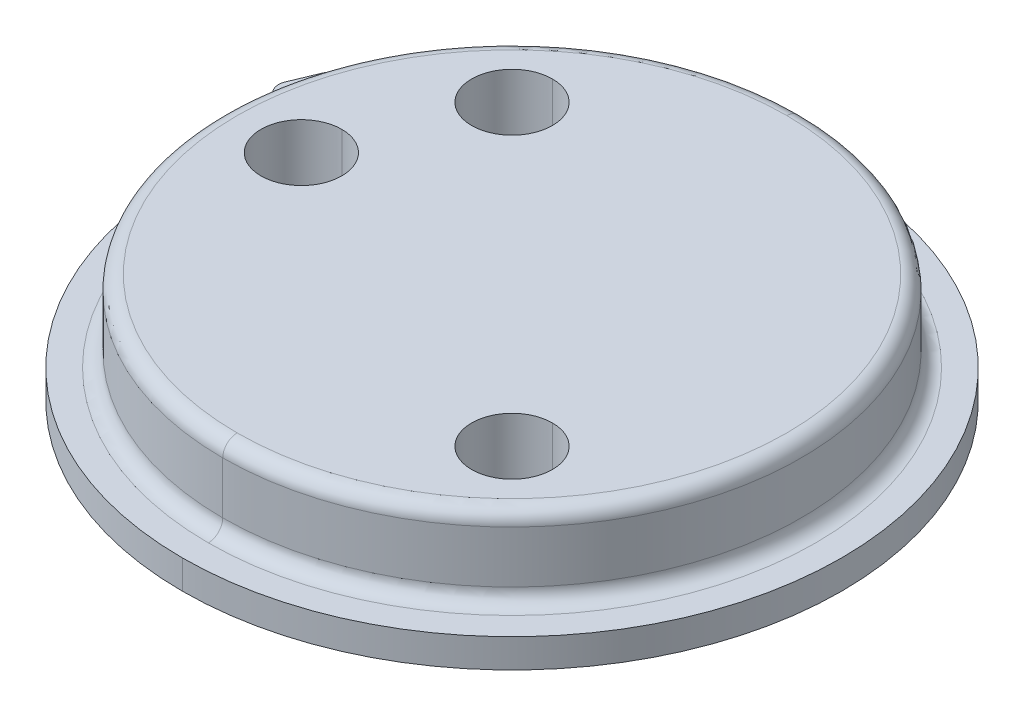
ISO-10303-21;
HEADER;
FILE_DESCRIPTION(('STEP AP214'),'2;1');
FILE_NAME('part.step','',(''),(''),'','','');
FILE_SCHEMA(('AUTOMOTIVE_DESIGN { 1 0 10303 214 1 1 1 1 }'));
ENDSEC;
DATA;
#1=APPLICATION_CONTEXT('core data for automotive mechanical design processes');
#2=APPLICATION_PROTOCOL_DEFINITION('international standard','automotive_design',2000,#1);
#3=PRODUCT_CONTEXT('',#1,'mechanical');
#4=PRODUCT('Part','Part','',(#3));
#5=PRODUCT_RELATED_PRODUCT_CATEGORY('part','',(#4));
#6=PRODUCT_DEFINITION_FORMATION('','',#4);
#7=PRODUCT_DEFINITION_CONTEXT('part definition',#1,'design');
#8=PRODUCT_DEFINITION('design','',#6,#7);
#9=PRODUCT_DEFINITION_SHAPE('','',#8);
#10=(LENGTH_UNIT() NAMED_UNIT(*) SI_UNIT(.MILLI.,.METRE.));
#11=(NAMED_UNIT(*) PLANE_ANGLE_UNIT() SI_UNIT($,.RADIAN.));
#12=(NAMED_UNIT(*) SI_UNIT($,.STERADIAN.) SOLID_ANGLE_UNIT());
#13=UNCERTAINTY_MEASURE_WITH_UNIT(LENGTH_MEASURE(1.E-05),#10,'distance_accuracy_value','');
#14=(GEOMETRIC_REPRESENTATION_CONTEXT(3) GLOBAL_UNCERTAINTY_ASSIGNED_CONTEXT((#13)) GLOBAL_UNIT_ASSIGNED_CONTEXT((#10,
#11,#12)) REPRESENTATION_CONTEXT('',''));
#15=CARTESIAN_POINT('',(0.,0.,0.));
#16=DIRECTION('',(0.,0.,1.));
#17=DIRECTION('',(1.,0.,0.));
#18=AXIS2_PLACEMENT_3D('',#15,#16,#17);
#19=CARTESIAN_POINT('',(-2.92,0.,0.));
#20=DIRECTION('',(0.,1.,0.));
#21=DIRECTION('',(0.,0.,1.));
#22=AXIS2_PLACEMENT_3D('',#19,#20,#21);
#23=CYLINDRICAL_SURFACE('',#22,0.56);
#24=DIRECTION('',(0.,-1.,0.));
#25=VECTOR('',#24,1.);
#26=CARTESIAN_POINT('',(-2.92,1.52,-0.56));
#27=LINE('',#26,#25);
#28=CARTESIAN_POINT('',(-2.92,1.52,-0.56));
#29=VERTEX_POINT('',#28);
#30=CARTESIAN_POINT('',(-2.92,0.,-0.56));
#31=VERTEX_POINT('',#30);
#32=EDGE_CURVE('E11',#29,#31,#27,.T.);
#33=ORIENTED_EDGE('',*,*,#32,.F.);
#34=CARTESIAN_POINT('',(-2.92,1.52,0.));
#35=DIRECTION('',(0.,-1.,0.));
#36=DIRECTION('',(0.,0.,1.));
#37=AXIS2_PLACEMENT_3D('',#34,#35,#36);
#38=CIRCLE('',#37,0.56);
#39=CARTESIAN_POINT('',(-2.92,1.52,0.56));
#40=VERTEX_POINT('',#39);
#41=EDGE_CURVE('E358',#40,#29,#38,.T.);
#42=ORIENTED_EDGE('',*,*,#41,.F.);
#43=DIRECTION('',(0.,-1.,0.));
#44=VECTOR('',#43,1.);
#45=CARTESIAN_POINT('',(-2.92,1.52,0.56));
#46=LINE('',#45,#44);
#47=CARTESIAN_POINT('',(-2.92,0.,0.56));
#48=VERTEX_POINT('',#47);
#49=EDGE_CURVE('E27',#40,#48,#46,.T.);
#50=ORIENTED_EDGE('',*,*,#49,.T.);
#51=CARTESIAN_POINT('',(-2.92,0.,0.));
#52=DIRECTION('',(0.,1.,0.));
#53=DIRECTION('',(0.,0.,-1.));
#54=AXIS2_PLACEMENT_3D('',#51,#52,#53);
#55=CIRCLE('',#54,0.56);
#56=EDGE_CURVE('E353',#31,#48,#55,.T.);
#57=ORIENTED_EDGE('',*,*,#56,.F.);
#58=EDGE_LOOP('',(#33,#42,#50,#57));
#59=FACE_BOUND('',#58,.T.);
#60=ADVANCED_FACE('F16',(#59),#23,.F.);
#61=CARTESIAN_POINT('',(-2.92,0.,0.));
#62=DIRECTION('',(0.,1.,0.));
#63=DIRECTION('',(0.,0.,1.));
#64=AXIS2_PLACEMENT_3D('',#61,#62,#63);
#65=CYLINDRICAL_SURFACE('',#64,0.56);
#66=CARTESIAN_POINT('',(-2.92,0.,0.));
#67=DIRECTION('',(0.,1.,0.));
#68=DIRECTION('',(0.,0.,1.));
#69=AXIS2_PLACEMENT_3D('',#66,#67,#68);
#70=CIRCLE('',#69,0.56);
#71=EDGE_CURVE('E371',#48,#31,#70,.T.);
#72=ORIENTED_EDGE('',*,*,#71,.F.);
#73=ORIENTED_EDGE('',*,*,#49,.F.);
#74=CARTESIAN_POINT('',(-2.92,1.52,0.));
#75=DIRECTION('',(0.,-1.,0.));
#76=DIRECTION('',(0.,0.,-1.));
#77=AXIS2_PLACEMENT_3D('',#74,#75,#76);
#78=CIRCLE('',#77,0.56);
#79=EDGE_CURVE('E354',#29,#40,#78,.T.);
#80=ORIENTED_EDGE('',*,*,#79,.F.);
#81=ORIENTED_EDGE('',*,*,#32,.T.);
#82=EDGE_LOOP('',(#72,#73,#80,#81));
#83=FACE_BOUND('',#82,.T.);
#84=ADVANCED_FACE('F593',(#83),#65,.F.);
#85=CARTESIAN_POINT('',(2.92,0.15,0.));
#86=DIRECTION('',(0.,-1.,0.));
#87=DIRECTION('',(0.,0.,-1.));
#88=AXIS2_PLACEMENT_3D('',#85,#86,#87);
#89=PLANE('',#88);
#90=CARTESIAN_POINT('',(2.92,0.15,0.));
#91=DIRECTION('',(0.,-1.,0.));
#92=DIRECTION('',(0.,0.,1.));
#93=AXIS2_PLACEMENT_3D('',#90,#91,#92);
#94=CIRCLE('',#93,0.35);
#95=CARTESIAN_POINT('',(2.92,0.15,0.35));
#96=VERTEX_POINT('',#95);
#97=CARTESIAN_POINT('',(2.92,0.15,-0.35));
#98=VERTEX_POINT('',#97);
#99=EDGE_CURVE('E41',#96,#98,#94,.T.);
#100=ORIENTED_EDGE('',*,*,#99,.T.);
#101=CARTESIAN_POINT('',(2.92,0.15,0.));
#102=DIRECTION('',(0.,-1.,0.));
#103=DIRECTION('',(0.,0.,-1.));
#104=AXIS2_PLACEMENT_3D('',#101,#102,#103);
#105=CIRCLE('',#104,0.35);
#106=EDGE_CURVE('E278',#98,#96,#105,.T.);
#107=ORIENTED_EDGE('',*,*,#106,.T.);
#108=EDGE_LOOP('',(#100,#107));
#109=FACE_BOUND('',#108,.T.);
#110=ADVANCED_FACE('F486',(#109),#89,.T.);
#111=CARTESIAN_POINT('',(2.92,0.15,0.));
#112=DIRECTION('',(0.,-1.,0.));
#113=DIRECTION('',(0.,0.,-1.));
#114=AXIS2_PLACEMENT_3D('',#111,#112,#113);
#115=CYLINDRICAL_SURFACE('',#114,0.35);
#116=DIRECTION('',(0.,1.,0.));
#117=VECTOR('',#116,1.);
#118=CARTESIAN_POINT('',(2.92,0.,0.35));
#119=LINE('',#118,#117);
#120=CARTESIAN_POINT('',(2.92,0.,0.35));
#121=VERTEX_POINT('',#120);
#122=EDGE_CURVE('E277',#121,#96,#119,.T.);
#123=ORIENTED_EDGE('',*,*,#122,.F.);
#124=CARTESIAN_POINT('',(2.92,0.,0.));
#125=DIRECTION('',(0.,1.,0.));
#126=DIRECTION('',(0.,0.,-1.));
#127=AXIS2_PLACEMENT_3D('',#124,#125,#126);
#128=CIRCLE('',#127,0.35);
#129=CARTESIAN_POINT('',(2.92,0.,-0.35));
#130=VERTEX_POINT('',#129);
#131=EDGE_CURVE('E326',#130,#121,#128,.T.);
#132=ORIENTED_EDGE('',*,*,#131,.F.);
#133=DIRECTION('',(0.,1.,0.));
#134=VECTOR('',#133,1.);
#135=CARTESIAN_POINT('',(2.92,0.,-0.35));
#136=LINE('',#135,#134);
#137=EDGE_CURVE('E274',#130,#98,#136,.T.);
#138=ORIENTED_EDGE('',*,*,#137,.T.);
#139=ORIENTED_EDGE('',*,*,#99,.F.);
#140=EDGE_LOOP('',(#123,#132,#138,#139));
#141=FACE_BOUND('',#140,.T.);
#142=ADVANCED_FACE('F487',(#141),#115,.F.);
#143=CARTESIAN_POINT('',(2.92,0.15,0.));
#144=DIRECTION('',(0.,-1.,0.));
#145=DIRECTION('',(0.,0.,-1.));
#146=AXIS2_PLACEMENT_3D('',#143,#144,#145);
#147=CYLINDRICAL_SURFACE('',#146,0.35);
#148=ORIENTED_EDGE('',*,*,#106,.F.);
#149=ORIENTED_EDGE('',*,*,#137,.F.);
#150=CARTESIAN_POINT('',(2.92,0.,0.));
#151=DIRECTION('',(0.,1.,0.));
#152=DIRECTION('',(0.,0.,1.));
#153=AXIS2_PLACEMENT_3D('',#150,#151,#152);
#154=CIRCLE('',#153,0.35);
#155=EDGE_CURVE('E330',#121,#130,#154,.T.);
#156=ORIENTED_EDGE('',*,*,#155,.F.);
#157=ORIENTED_EDGE('',*,*,#122,.T.);
#158=EDGE_LOOP('',(#148,#149,#156,#157));
#159=FACE_BOUND('',#158,.T.);
#160=ADVANCED_FACE('F483',(#159),#147,.F.);
#161=CARTESIAN_POINT('',(-2.064751801065,1.52,-2.064751801065));
#162=DIRECTION('',(0.,-1.,0.));
#163=DIRECTION('',(0.,0.,-1.));
#164=AXIS2_PLACEMENT_3D('',#161,#162,#163);
#165=CYLINDRICAL_SURFACE('',#164,0.56);
#166=DIRECTION('',(0.,1.,0.));
#167=VECTOR('',#166,1.);
#168=CARTESIAN_POINT('',(-2.064751801065,0.,-1.504751801065));
#169=LINE('',#168,#167);
#170=CARTESIAN_POINT('',(-2.064751801065,0.,-1.504751801065));
#171=VERTEX_POINT('',#170);
#172=CARTESIAN_POINT('',(-2.064751801065,1.52,-1.504751801065));
#173=VERTEX_POINT('',#172);
#174=EDGE_CURVE('E349',#171,#173,#169,.T.);
#175=ORIENTED_EDGE('',*,*,#174,.F.);
#176=CARTESIAN_POINT('',(-2.064751801065,0.,-2.064751801065));
#177=DIRECTION('',(0.,1.,0.));
#178=DIRECTION('',(0.,0.,-1.));
#179=AXIS2_PLACEMENT_3D('',#176,#177,#178);
#180=CIRCLE('',#179,0.56);
#181=CARTESIAN_POINT('',(-2.064751801065,0.,-2.624751801065));
#182=VERTEX_POINT('',#181);
#183=EDGE_CURVE('E301',#182,#171,#180,.T.);
#184=ORIENTED_EDGE('',*,*,#183,.F.);
#185=DIRECTION('',(0.,1.,0.));
#186=VECTOR('',#185,1.);
#187=CARTESIAN_POINT('',(-2.064751801065,0.,-2.624751801065));
#188=LINE('',#187,#186);
#189=CARTESIAN_POINT('',(-2.064751801065,1.52,-2.624751801065));
#190=VERTEX_POINT('',#189);
#191=EDGE_CURVE('E366',#182,#190,#188,.T.);
#192=ORIENTED_EDGE('',*,*,#191,.T.);
#193=CARTESIAN_POINT('',(-2.064751801065,1.52,-2.064751801065));
#194=DIRECTION('',(0.,-1.,0.));
#195=DIRECTION('',(0.,0.,1.));
#196=AXIS2_PLACEMENT_3D('',#193,#194,#195);
#197=CIRCLE('',#196,0.56);
#198=EDGE_CURVE('E419',#173,#190,#197,.T.);
#199=ORIENTED_EDGE('',*,*,#198,.F.);
#200=EDGE_LOOP('',(#175,#184,#192,#199));
#201=FACE_BOUND('',#200,.T.);
#202=ADVANCED_FACE('F636',(#201),#165,.F.);
#203=CARTESIAN_POINT('',(-2.064751801065,1.52,-2.064751801065));
#204=DIRECTION('',(0.,-1.,0.));
#205=DIRECTION('',(0.,0.,-1.));
#206=AXIS2_PLACEMENT_3D('',#203,#204,#205);
#207=CYLINDRICAL_SURFACE('',#206,0.56);
#208=CARTESIAN_POINT('',(-2.064751801065,1.52,-2.064751801065));
#209=DIRECTION('',(0.,-1.,0.));
#210=DIRECTION('',(0.,0.,-1.));
#211=AXIS2_PLACEMENT_3D('',#208,#209,#210);
#212=CIRCLE('',#211,0.56);
#213=EDGE_CURVE('E423',#190,#173,#212,.T.);
#214=ORIENTED_EDGE('',*,*,#213,.F.);
#215=ORIENTED_EDGE('',*,*,#191,.F.);
#216=CARTESIAN_POINT('',(-2.064751801065,0.,-2.064751801065));
#217=DIRECTION('',(0.,1.,0.));
#218=DIRECTION('',(0.,0.,1.));
#219=AXIS2_PLACEMENT_3D('',#216,#217,#218);
#220=CIRCLE('',#219,0.56);
#221=EDGE_CURVE('E305',#171,#182,#220,.T.);
#222=ORIENTED_EDGE('',*,*,#221,.F.);
#223=ORIENTED_EDGE('',*,*,#174,.T.);
#224=EDGE_LOOP('',(#214,#215,#222,#223));
#225=FACE_BOUND('',#224,.T.);
#226=ADVANCED_FACE('F621',(#225),#207,.F.);
#227=CARTESIAN_POINT('',(0.,28.41036291267,0.));
#228=DIRECTION('',(0.,1.,0.));
#229=DIRECTION('',(0.,0.,1.));
#230=AXIS2_PLACEMENT_3D('',#227,#228,#229);
#231=CYLINDRICAL_SURFACE('',#230,4.57);
#232=DIRECTION('',(0.,-1.,0.));
#233=VECTOR('',#232,1.);
#234=CARTESIAN_POINT('',(0.,0.4,-4.57));
#235=LINE('',#234,#233);
#236=CARTESIAN_POINT('',(0.,0.4,-4.57));
#237=VERTEX_POINT('',#236);
#238=CARTESIAN_POINT('',(0.,0.,-4.57));
#239=VERTEX_POINT('',#238);
#240=EDGE_CURVE('E267',#237,#239,#235,.T.);
#241=ORIENTED_EDGE('',*,*,#240,.F.);
#242=CARTESIAN_POINT('',(0.,0.4,0.));
#243=DIRECTION('',(0.,1.,0.));
#244=DIRECTION('',(0.,0.,1.));
#245=AXIS2_PLACEMENT_3D('',#242,#243,#244);
#246=CIRCLE('',#245,4.57);
#247=CARTESIAN_POINT('',(0.,0.4,4.57));
#248=VERTEX_POINT('',#247);
#249=EDGE_CURVE('E335',#248,#237,#246,.T.);
#250=ORIENTED_EDGE('',*,*,#249,.F.);
#251=DIRECTION('',(0.,-1.,0.));
#252=VECTOR('',#251,1.);
#253=CARTESIAN_POINT('',(0.,0.4,4.57));
#254=LINE('',#253,#252);
#255=CARTESIAN_POINT('',(0.,0.,4.57));
#256=VERTEX_POINT('',#255);
#257=EDGE_CURVE('E367',#248,#256,#254,.T.);
#258=ORIENTED_EDGE('',*,*,#257,.T.);
#259=CARTESIAN_POINT('',(0.,0.,0.));
#260=DIRECTION('',(0.,-1.,0.));
#261=DIRECTION('',(0.,0.,-1.));
#262=AXIS2_PLACEMENT_3D('',#259,#260,#261);
#263=CIRCLE('',#262,4.57);
#264=EDGE_CURVE('E384',#239,#256,#263,.T.);
#265=ORIENTED_EDGE('',*,*,#264,.F.);
#266=EDGE_LOOP('',(#241,#250,#258,#265));
#267=FACE_BOUND('',#266,.T.);
#268=ADVANCED_FACE('F572',(#267),#231,.T.);
#269=CARTESIAN_POINT('',(0.,28.41036291267,0.));
#270=DIRECTION('',(0.,1.,0.));
#271=DIRECTION('',(0.,0.,1.));
#272=AXIS2_PLACEMENT_3D('',#269,#270,#271);
#273=CYLINDRICAL_SURFACE('',#272,4.57);
#274=CARTESIAN_POINT('',(0.,0.,0.));
#275=DIRECTION('',(0.,-1.,0.));
#276=DIRECTION('',(-0.87416579232243,0.,-0.485627601700417));
#277=AXIS2_PLACEMENT_3D('',#274,#275,#276);
#278=CIRCLE('',#277,4.57);
#279=CARTESIAN_POINT('',(-3.994937670913,0.,-2.219318139771));
#280=VERTEX_POINT('',#279);
#281=EDGE_CURVE('E377',#280,#239,#278,.T.);
#282=ORIENTED_EDGE('',*,*,#281,.F.);
#283=DIRECTION('',(0.,1.,0.));
#284=VECTOR('',#283,1.);
#285=CARTESIAN_POINT('',(-3.994937670913,0.,-2.219318139771));
#286=LINE('',#285,#284);
#287=CARTESIAN_POINT('',(-3.994937670913,0.4,-2.219318139771));
#288=VERTEX_POINT('',#287);
#289=EDGE_CURVE('E225',#280,#288,#286,.T.);
#290=ORIENTED_EDGE('',*,*,#289,.T.);
#291=CARTESIAN_POINT('',(0.,0.4,0.));
#292=DIRECTION('',(0.,1.,0.));
#293=DIRECTION('',(0.,0.,-1.));
#294=AXIS2_PLACEMENT_3D('',#291,#292,#293);
#295=CIRCLE('',#294,4.57);
#296=EDGE_CURVE('E248',#237,#288,#295,.T.);
#297=ORIENTED_EDGE('',*,*,#296,.F.);
#298=ORIENTED_EDGE('',*,*,#240,.T.);
#299=EDGE_LOOP('',(#282,#290,#297,#298));
#300=FACE_BOUND('',#299,.T.);
#301=ADVANCED_FACE('F569',(#300),#273,.T.);
#302=CARTESIAN_POINT('',(-4.134786782159,0.4,-2.362294452788));
#303=DIRECTION('',(0.,-1.,0.));
#304=DIRECTION('',(0.,0.,-1.));
#305=AXIS2_PLACEMENT_3D('',#302,#303,#304);
#306=CYLINDRICAL_SURFACE('',#305,0.2);
#307=CARTESIAN_POINT('',(-4.134786782159,0.,-2.362294452788));
#308=DIRECTION('',(0.,1.,0.));
#309=DIRECTION('',(-0.382437806275593,0.,0.923981235919384));
#310=AXIS2_PLACEMENT_3D('',#307,#308,#309);
#311=CIRCLE('',#310,0.2);
#312=CARTESIAN_POINT('',(-4.211274343414,0.,-2.177498205604));
#313=VERTEX_POINT('',#312);
#314=CARTESIAN_POINT('',(-4.134786782159,0.,-2.162294452788));
#315=VERTEX_POINT('',#314);
#316=EDGE_CURVE('E220',#313,#315,#311,.T.);
#317=ORIENTED_EDGE('',*,*,#316,.F.);
#318=DIRECTION('',(0.,1.,0.));
#319=VECTOR('',#318,1.);
#320=CARTESIAN_POINT('',(-4.211274343414,0.,-2.177498205604));
#321=LINE('',#320,#319);
#322=CARTESIAN_POINT('',(-4.211274343414,0.4,-2.177498205604));
#323=VERTEX_POINT('',#322);
#324=EDGE_CURVE('E212',#313,#323,#321,.T.);
#325=ORIENTED_EDGE('',*,*,#324,.T.);
#326=CARTESIAN_POINT('',(-4.134786782159,0.4,-2.362294452788));
#327=DIRECTION('',(0.,-1.,0.));
#328=DIRECTION('',(0.,0.,1.));
#329=AXIS2_PLACEMENT_3D('',#326,#327,#328);
#330=CIRCLE('',#329,0.2);
#331=CARTESIAN_POINT('',(-4.134786782159,0.4,-2.162294452788));
#332=VERTEX_POINT('',#331);
#333=EDGE_CURVE('E217',#332,#323,#330,.T.);
#334=ORIENTED_EDGE('',*,*,#333,.F.);
#335=CARTESIAN_POINT('',(-4.134786782159,0.4,-2.362294452788));
#336=DIRECTION('',(0.,-1.,0.));
#337=DIRECTION('',(0.699245556225529,0.,0.71488156508533));
#338=AXIS2_PLACEMENT_3D('',#335,#336,#337);
#339=CIRCLE('',#338,0.2);
#340=EDGE_CURVE('E240',#288,#332,#339,.T.);
#341=ORIENTED_EDGE('',*,*,#340,.F.);
#342=ORIENTED_EDGE('',*,*,#289,.F.);
#343=CARTESIAN_POINT('',(-4.134786782159,0.,-2.362294452788));
#344=DIRECTION('',(0.,1.,0.));
#345=DIRECTION('',(0.,0.,1.));
#346=AXIS2_PLACEMENT_3D('',#343,#344,#345);
#347=CIRCLE('',#346,0.2);
#348=EDGE_CURVE('E373',#315,#280,#347,.T.);
#349=ORIENTED_EDGE('',*,*,#348,.F.);
#350=EDGE_LOOP('',(#317,#325,#334,#341,#342,#349));
#351=FACE_BOUND('',#350,.T.);
#352=ADVANCED_FACE('F214',(#351),#306,.F.);
#353=CARTESIAN_POINT('',(0.153517022237,0.4,-0.3709017403969));
#354=DIRECTION('',(0.382437806275593,0.,-0.923981235919384));
#355=DIRECTION('',(0.,-1.,0.));
#356=AXIS2_PLACEMENT_3D('',#353,#354,#355);
#357=PLANE('',#356);
#358=DIRECTION('',(0.,-1.,0.));
#359=VECTOR('',#358,1.);
#360=CARTESIAN_POINT('',(-4.586457409547,0.4,-2.332787277704));
#361=LINE('',#360,#359);
#362=CARTESIAN_POINT('',(-4.586457409547,0.4,-2.332787277704));
#363=VERTEX_POINT('',#362);
#364=CARTESIAN_POINT('',(-4.586457409547,0.,-2.332787277704));
#365=VERTEX_POINT('',#364);
#366=EDGE_CURVE('E226',#363,#365,#361,.T.);
#367=ORIENTED_EDGE('',*,*,#366,.F.);
#368=DIRECTION('',(-0.923981235919384,0.,-0.382437806275593));
#369=VECTOR('',#368,1.);
#370=CARTESIAN_POINT('',(-4.211274343414,0.4,-2.177498205604));
#371=LINE('',#370,#369);
#372=EDGE_CURVE('E229',#323,#363,#371,.T.);
#373=ORIENTED_EDGE('',*,*,#372,.F.);
#374=ORIENTED_EDGE('',*,*,#324,.F.);
#375=DIRECTION('',(0.923981235919384,0.,0.382437806275593));
#376=VECTOR('',#375,1.);
#377=CARTESIAN_POINT('',(-4.586457409547,0.,-2.332787277704));
#378=LINE('',#377,#376);
#379=EDGE_CURVE('E339',#365,#313,#378,.T.);
#380=ORIENTED_EDGE('',*,*,#379,.F.);
#381=EDGE_LOOP('',(#367,#373,#374,#380));
#382=FACE_BOUND('',#381,.T.);
#383=ADVANCED_FACE('F230',(#382),#357,.T.);
#384=CARTESIAN_POINT('',(-4.662944970803,0.4,-2.147991030521));
#385=DIRECTION('',(0.,-1.,0.));
#386=DIRECTION('',(0.,0.,-1.));
#387=AXIS2_PLACEMENT_3D('',#384,#385,#386);
#388=CYLINDRICAL_SURFACE('',#387,0.2);
#389=CARTESIAN_POINT('',(-4.662944970803,0.4,-2.147991030521));
#390=DIRECTION('',(0.,1.,0.));
#391=DIRECTION('',(0.382437806275593,0.,-0.923981235919384));
#392=AXIS2_PLACEMENT_3D('',#389,#390,#391);
#393=CIRCLE('',#392,0.2);
#394=CARTESIAN_POINT('',(-4.662944970803,0.4,-2.347991030521));
#395=VERTEX_POINT('',#394);
#396=EDGE_CURVE('E235',#363,#395,#393,.T.);
#397=ORIENTED_EDGE('',*,*,#396,.F.);
#398=ORIENTED_EDGE('',*,*,#366,.T.);
#399=CARTESIAN_POINT('',(-4.662944970803,0.,-2.147991030521));
#400=DIRECTION('',(0.,-1.,0.));
#401=DIRECTION('',(0.,0.,-1.));
#402=AXIS2_PLACEMENT_3D('',#399,#400,#401);
#403=CIRCLE('',#402,0.2);
#404=CARTESIAN_POINT('',(-4.662944970803,0.,-2.347991030521));
#405=VERTEX_POINT('',#404);
#406=EDGE_CURVE('E342',#405,#365,#403,.T.);
#407=ORIENTED_EDGE('',*,*,#406,.F.);
#408=DIRECTION('',(0.,1.,0.));
#409=VECTOR('',#408,1.);
#410=CARTESIAN_POINT('',(-4.662944970803,0.,-2.347991030521));
#411=LINE('',#410,#409);
#412=EDGE_CURVE('E295',#405,#395,#411,.T.);
#413=ORIENTED_EDGE('',*,*,#412,.T.);
#414=EDGE_LOOP('',(#397,#398,#407,#413));
#415=FACE_BOUND('',#414,.T.);
#416=ADVANCED_FACE('F528',(#415),#388,.T.);
#417=CARTESIAN_POINT('',(-4.21,0.4,0.));
#418=DIRECTION('',(0.,1.,0.));
#419=DIRECTION('',(1.,0.,0.));
#420=AXIS2_PLACEMENT_3D('',#417,#418,#419);
#421=PLANE('',#420);
#422=CARTESIAN_POINT('',(0.,0.4,0.));
#423=DIRECTION('',(0.,-1.,0.));
#424=DIRECTION('',(0.,0.,1.));
#425=AXIS2_PLACEMENT_3D('',#422,#423,#424);
#426=CIRCLE('',#425,4.21);
#427=CARTESIAN_POINT('',(0.,0.4,4.21));
#428=VERTEX_POINT('',#427);
#429=CARTESIAN_POINT('',(0.,0.4,-4.21));
#430=VERTEX_POINT('',#429);
#431=EDGE_CURVE('E316',#428,#430,#426,.T.);
#432=ORIENTED_EDGE('',*,*,#431,.T.);
#433=CARTESIAN_POINT('',(0.,0.4,0.));
#434=DIRECTION('',(0.,-1.,0.));
#435=DIRECTION('',(0.,0.,-1.));
#436=AXIS2_PLACEMENT_3D('',#433,#434,#435);
#437=CIRCLE('',#436,4.21);
#438=EDGE_CURVE('E363',#430,#428,#437,.T.);
#439=ORIENTED_EDGE('',*,*,#438,.T.);
#440=EDGE_LOOP('',(#432,#439));
#441=FACE_BOUND('',#440,.T.);
#442=ORIENTED_EDGE('',*,*,#249,.T.);
#443=ORIENTED_EDGE('',*,*,#296,.T.);
#444=ORIENTED_EDGE('',*,*,#340,.T.);
#445=ORIENTED_EDGE('',*,*,#333,.T.);
#446=ORIENTED_EDGE('',*,*,#372,.T.);
#447=ORIENTED_EDGE('',*,*,#396,.T.);
#448=CARTESIAN_POINT('',(-4.662944970803,0.4,-2.147991030521));
#449=DIRECTION('',(0.,1.,0.));
#450=DIRECTION('',(0.,0.,-1.));
#451=AXIS2_PLACEMENT_3D('',#448,#449,#450);
#452=CIRCLE('',#451,0.2);
#453=CARTESIAN_POINT('',(-4.847720877305,0.4,-2.224527716994));
#454=VERTEX_POINT('',#453);
#455=EDGE_CURVE('E338',#395,#454,#452,.T.);
#456=ORIENTED_EDGE('',*,*,#455,.T.);
#457=DIRECTION('',(-0.382683432365094,0.,0.923879532511285));
#458=VECTOR('',#457,1.);
#459=CARTESIAN_POINT('',(-4.847720877305,0.4,-2.224527716994));
#460=LINE('',#459,#458);
#461=CARTESIAN_POINT('',(-5.000280636424,0.4,-1.856215877457));
#462=VERTEX_POINT('',#461);
#463=EDGE_CURVE('E296',#454,#462,#460,.T.);
#464=ORIENTED_EDGE('',*,*,#463,.T.);
#465=CARTESIAN_POINT('',(-4.815504729921,0.4,-1.779679190984));
#466=DIRECTION('',(0.,1.,0.));
#467=DIRECTION('',(-0.923879532511285,0.,-0.382683432365094));
#468=AXIS2_PLACEMENT_3D('',#465,#466,#467);
#469=CIRCLE('',#468,0.2);
#470=CARTESIAN_POINT('',(-4.890754973869,0.4,-1.594375654088));
#471=VERTEX_POINT('',#470);
#472=EDGE_CURVE('E20',#462,#471,#469,.T.);
#473=ORIENTED_EDGE('',*,*,#472,.T.);
#474=DIRECTION('',(0.926517684476062,0.,0.376251219736385));
#475=VECTOR('',#474,1.);
#476=CARTESIAN_POINT('',(-4.890754973869,0.4,-1.594375654088));
#477=LINE('',#476,#475);
#478=CARTESIAN_POINT('',(-4.517067570848,0.4,-1.4426242698));
#479=VERTEX_POINT('',#478);
#480=EDGE_CURVE('E285',#471,#479,#477,.T.);
#481=ORIENTED_EDGE('',*,*,#480,.T.);
#482=CARTESIAN_POINT('',(-4.592317814796,0.4,-1.257320732905));
#483=DIRECTION('',(0.,-1.,0.));
#484=DIRECTION('',(0.376251219736385,0.,-0.926517684476062));
#485=AXIS2_PLACEMENT_3D('',#482,#483,#484);
#486=CIRCLE('',#485,0.2);
#487=CARTESIAN_POINT('',(-4.392366868823,0.4,-1.261750090021));
#488=VERTEX_POINT('',#487);
#489=EDGE_CURVE('E331',#479,#488,#486,.T.);
#490=ORIENTED_EDGE('',*,*,#489,.T.);
#491=CARTESIAN_POINT('',(0.,0.4,0.));
#492=DIRECTION('',(0.,1.,0.));
#493=DIRECTION('',(-0.96113060586928,0.,-0.276094111602094));
#494=AXIS2_PLACEMENT_3D('',#491,#492,#493);
#495=CIRCLE('',#494,4.57);
#496=EDGE_CURVE('E370',#488,#248,#495,.T.);
#497=ORIENTED_EDGE('',*,*,#496,.T.);
#498=EDGE_LOOP('',(#442,#443,#444,#445,#446,#447,#456,#464,#473,#481,#490,#497));
#499=FACE_BOUND('',#498,.T.);
#500=ADVANCED_FACE('F238',(#441,#499),#421,.T.);
#501=CARTESIAN_POINT('',(-4.662944970803,0.4,-2.147991030521));
#502=DIRECTION('',(0.,-1.,0.));
#503=DIRECTION('',(0.,0.,-1.));
#504=AXIS2_PLACEMENT_3D('',#501,#502,#503);
#505=CYLINDRICAL_SURFACE('',#504,0.2);
#506=ORIENTED_EDGE('',*,*,#412,.F.);
#507=CARTESIAN_POINT('',(-4.662944970803,0.,-2.147991030521));
#508=DIRECTION('',(0.,-1.,0.));
#509=DIRECTION('',(-0.923879532511285,0.,-0.382683432365094));
#510=AXIS2_PLACEMENT_3D('',#507,#508,#509);
#511=CIRCLE('',#510,0.2);
#512=CARTESIAN_POINT('',(-4.847720877305,0.,-2.224527716994));
#513=VERTEX_POINT('',#512);
#514=EDGE_CURVE('E400',#513,#405,#511,.T.);
#515=ORIENTED_EDGE('',*,*,#514,.F.);
#516=DIRECTION('',(0.,1.,0.));
#517=VECTOR('',#516,1.);
#518=CARTESIAN_POINT('',(-4.847720877305,0.,-2.224527716994));
#519=LINE('',#518,#517);
#520=EDGE_CURVE('E291',#513,#454,#519,.T.);
#521=ORIENTED_EDGE('',*,*,#520,.T.);
#522=ORIENTED_EDGE('',*,*,#455,.F.);
#523=EDGE_LOOP('',(#506,#515,#521,#522));
#524=FACE_BOUND('',#523,.T.);
#525=ADVANCED_FACE('F523',(#524),#505,.T.);
#526=CARTESIAN_POINT('',(-4.924277908285,0.4,-2.039702694506));
#527=DIRECTION('',(-0.923879532511285,0.,-0.382683432365094));
#528=DIRECTION('',(-0.382683432365094,0.,0.923879532511285));
#529=AXIS2_PLACEMENT_3D('',#526,#527,#528);
#530=PLANE('',#529);
#531=DIRECTION('',(0.,-1.,0.));
#532=VECTOR('',#531,1.);
#533=CARTESIAN_POINT('',(-5.000280636424,0.4,-1.856215877457));
#534=LINE('',#533,#532);
#535=CARTESIAN_POINT('',(-5.000280636424,0.,-1.856215877457));
#536=VERTEX_POINT('',#535);
#537=EDGE_CURVE('E385',#462,#536,#534,.T.);
#538=ORIENTED_EDGE('',*,*,#537,.F.);
#539=ORIENTED_EDGE('',*,*,#463,.F.);
#540=ORIENTED_EDGE('',*,*,#520,.F.);
#541=DIRECTION('',(0.382683432365094,0.,-0.923879532511285));
#542=VECTOR('',#541,1.);
#543=CARTESIAN_POINT('',(-5.000280636424,0.,-1.856215877457));
#544=LINE('',#543,#542);
#545=EDGE_CURVE('E396',#536,#513,#544,.T.);
#546=ORIENTED_EDGE('',*,*,#545,.F.);
#547=EDGE_LOOP('',(#538,#539,#540,#546));
#548=FACE_BOUND('',#547,.T.);
#549=ADVANCED_FACE('F518',(#548),#530,.T.);
#550=CARTESIAN_POINT('',(-4.815504729921,0.4,-1.779679190984));
#551=DIRECTION('',(0.,-1.,0.));
#552=DIRECTION('',(0.,0.,-1.));
#553=AXIS2_PLACEMENT_3D('',#550,#551,#552);
#554=CYLINDRICAL_SURFACE('',#553,0.2);
#555=DIRECTION('',(0.,1.,0.));
#556=VECTOR('',#555,1.);
#557=CARTESIAN_POINT('',(-4.890754973869,0.,-1.594375654088));
#558=LINE('',#557,#556);
#559=CARTESIAN_POINT('',(-4.890754973869,0.,-1.594375654088));
#560=VERTEX_POINT('',#559);
#561=EDGE_CURVE('E289',#560,#471,#558,.T.);
#562=ORIENTED_EDGE('',*,*,#561,.T.);
#563=ORIENTED_EDGE('',*,*,#472,.F.);
#564=ORIENTED_EDGE('',*,*,#537,.T.);
#565=CARTESIAN_POINT('',(-4.815504729921,0.,-1.779679190984));
#566=DIRECTION('',(0.,-1.,0.));
#567=DIRECTION('',(-0.376251219736385,0.,0.926517684476062));
#568=AXIS2_PLACEMENT_3D('',#565,#566,#567);
#569=CIRCLE('',#568,0.2);
#570=EDGE_CURVE('E315',#560,#536,#569,.T.);
#571=ORIENTED_EDGE('',*,*,#570,.F.);
#572=EDGE_LOOP('',(#562,#563,#564,#571));
#573=FACE_BOUND('',#572,.T.);
#574=ADVANCED_FACE('F513',(#573),#554,.T.);
#575=CARTESIAN_POINT('',(-0.1365548437189,0.4,0.3362659600016));
#576=DIRECTION('',(0.376251219736385,0.,-0.926517684476062));
#577=DIRECTION('',(0.,-1.,0.));
#578=AXIS2_PLACEMENT_3D('',#575,#576,#577);
#579=PLANE('',#578);
#580=DIRECTION('',(0.,-1.,0.));
#581=VECTOR('',#580,1.);
#582=CARTESIAN_POINT('',(-4.517067570848,0.4,-1.4426242698));
#583=LINE('',#582,#581);
#584=CARTESIAN_POINT('',(-4.517067570848,0.,-1.4426242698));
#585=VERTEX_POINT('',#584);
#586=EDGE_CURVE('E290',#479,#585,#583,.T.);
#587=ORIENTED_EDGE('',*,*,#586,.F.);
#588=ORIENTED_EDGE('',*,*,#480,.F.);
#589=ORIENTED_EDGE('',*,*,#561,.F.);
#590=DIRECTION('',(-0.926517684476062,0.,-0.376251219736385));
#591=VECTOR('',#590,1.);
#592=CARTESIAN_POINT('',(-4.517067570848,0.,-1.4426242698));
#593=LINE('',#592,#591);
#594=EDGE_CURVE('E311',#585,#560,#593,.T.);
#595=ORIENTED_EDGE('',*,*,#594,.F.);
#596=EDGE_LOOP('',(#587,#588,#589,#595));
#597=FACE_BOUND('',#596,.T.);
#598=ADVANCED_FACE('F509',(#597),#579,.F.);
#599=CARTESIAN_POINT('',(-4.592317814796,0.4,-1.257320732905));
#600=DIRECTION('',(0.,-1.,0.));
#601=DIRECTION('',(0.,0.,-1.));
#602=AXIS2_PLACEMENT_3D('',#599,#600,#601);
#603=CYLINDRICAL_SURFACE('',#602,0.2);
#604=DIRECTION('',(0.,1.,0.));
#605=VECTOR('',#604,1.);
#606=CARTESIAN_POINT('',(-4.392366868823,0.,-1.261750090021));
#607=LINE('',#606,#605);
#608=CARTESIAN_POINT('',(-4.392366868823,0.,-1.261750090021));
#609=VERTEX_POINT('',#608);
#610=EDGE_CURVE('E334',#609,#488,#607,.T.);
#611=ORIENTED_EDGE('',*,*,#610,.T.);
#612=ORIENTED_EDGE('',*,*,#489,.F.);
#613=ORIENTED_EDGE('',*,*,#586,.T.);
#614=CARTESIAN_POINT('',(-4.592317814796,0.,-1.257320732905));
#615=DIRECTION('',(0.,1.,0.));
#616=DIRECTION('',(0.999754729865494,0.,-0.0221467855810698));
#617=AXIS2_PLACEMENT_3D('',#614,#615,#616);
#618=CIRCLE('',#617,0.2);
#619=EDGE_CURVE('E300',#609,#585,#618,.T.);
#620=ORIENTED_EDGE('',*,*,#619,.F.);
#621=EDGE_LOOP('',(#611,#612,#613,#620));
#622=FACE_BOUND('',#621,.T.);
#623=ADVANCED_FACE('F503',(#622),#603,.F.);
#624=CARTESIAN_POINT('',(0.,28.41036291267,0.));
#625=DIRECTION('',(0.,1.,0.));
#626=DIRECTION('',(0.,0.,1.));
#627=AXIS2_PLACEMENT_3D('',#624,#625,#626);
#628=CYLINDRICAL_SURFACE('',#627,4.57);
#629=ORIENTED_EDGE('',*,*,#257,.F.);
#630=ORIENTED_EDGE('',*,*,#496,.F.);
#631=ORIENTED_EDGE('',*,*,#610,.F.);
#632=CARTESIAN_POINT('',(0.,0.,0.));
#633=DIRECTION('',(0.,-1.,0.));
#634=DIRECTION('',(0.,0.,1.));
#635=AXIS2_PLACEMENT_3D('',#632,#633,#634);
#636=CIRCLE('',#635,4.57);
#637=EDGE_CURVE('E306',#256,#609,#636,.T.);
#638=ORIENTED_EDGE('',*,*,#637,.F.);
#639=EDGE_LOOP('',(#629,#630,#631,#638));
#640=FACE_BOUND('',#639,.T.);
#641=ADVANCED_FACE('F492',(#640),#628,.T.);
#642=CARTESIAN_POINT('',(0.,0.,0.));
#643=DIRECTION('',(0.,-1.,0.));
#644=DIRECTION('',(0.,0.,-1.));
#645=AXIS2_PLACEMENT_3D('',#642,#643,#644);
#646=PLANE('',#645);
#647=ORIENTED_EDGE('',*,*,#56,.T.);
#648=ORIENTED_EDGE('',*,*,#71,.T.);
#649=EDGE_LOOP('',(#647,#648));
#650=FACE_BOUND('',#649,.T.);
#651=ORIENTED_EDGE('',*,*,#131,.T.);
#652=ORIENTED_EDGE('',*,*,#155,.T.);
#653=EDGE_LOOP('',(#651,#652));
#654=FACE_BOUND('',#653,.T.);
#655=ORIENTED_EDGE('',*,*,#183,.T.);
#656=ORIENTED_EDGE('',*,*,#221,.T.);
#657=EDGE_LOOP('',(#655,#656));
#658=FACE_BOUND('',#657,.T.);
#659=CARTESIAN_POINT('',(2.064751801065,0.,2.064751801065));
#660=DIRECTION('',(0.,1.,0.));
#661=DIRECTION('',(0.,0.,-1.));
#662=AXIS2_PLACEMENT_3D('',#659,#660,#661);
#663=CIRCLE('',#662,0.56);
#664=CARTESIAN_POINT('',(2.064751801065,0.,1.504751801065));
#665=VERTEX_POINT('',#664);
#666=CARTESIAN_POINT('',(2.064751801065,0.,2.624751801065));
#667=VERTEX_POINT('',#666);
#668=EDGE_CURVE('E297',#665,#667,#663,.T.);
#669=ORIENTED_EDGE('',*,*,#668,.T.);
#670=CARTESIAN_POINT('',(2.064751801065,0.,2.064751801065));
#671=DIRECTION('',(0.,1.,0.));
#672=DIRECTION('',(0.,0.,1.));
#673=AXIS2_PLACEMENT_3D('',#670,#671,#672);
#674=CIRCLE('',#673,0.56);
#675=EDGE_CURVE('E252',#667,#665,#674,.T.);
#676=ORIENTED_EDGE('',*,*,#675,.T.);
#677=EDGE_LOOP('',(#669,#676));
#678=FACE_BOUND('',#677,.T.);
#679=ORIENTED_EDGE('',*,*,#619,.T.);
#680=ORIENTED_EDGE('',*,*,#594,.T.);
#681=ORIENTED_EDGE('',*,*,#570,.T.);
#682=ORIENTED_EDGE('',*,*,#545,.T.);
#683=ORIENTED_EDGE('',*,*,#514,.T.);
#684=ORIENTED_EDGE('',*,*,#406,.T.);
#685=ORIENTED_EDGE('',*,*,#379,.T.);
#686=ORIENTED_EDGE('',*,*,#316,.T.);
#687=ORIENTED_EDGE('',*,*,#348,.T.);
#688=ORIENTED_EDGE('',*,*,#281,.T.);
#689=ORIENTED_EDGE('',*,*,#264,.T.);
#690=ORIENTED_EDGE('',*,*,#637,.T.);
#691=EDGE_LOOP('',(#679,#680,#681,#682,#683,#684,#685,#686,#687,#688,#689,#690));
#692=FACE_BOUND('',#691,.T.);
#693=ADVANCED_FACE('F489',(#650,#654,#658,#678,#692),#646,.T.);
#694=CARTESIAN_POINT('',(2.064751801065,0.,2.064751801065));
#695=DIRECTION('',(0.,1.,0.));
#696=DIRECTION('',(0.,0.,1.));
#697=AXIS2_PLACEMENT_3D('',#694,#695,#696);
#698=CYLINDRICAL_SURFACE('',#697,0.56);
#699=DIRECTION('',(0.,-1.,0.));
#700=VECTOR('',#699,1.);
#701=CARTESIAN_POINT('',(2.064751801065,1.52,1.504751801065));
#702=LINE('',#701,#700);
#703=CARTESIAN_POINT('',(2.064751801065,1.52,1.504751801065));
#704=VERTEX_POINT('',#703);
#705=EDGE_CURVE('E273',#704,#665,#702,.T.);
#706=ORIENTED_EDGE('',*,*,#705,.F.);
#707=CARTESIAN_POINT('',(2.064751801065,1.52,2.064751801065));
#708=DIRECTION('',(0.,-1.,0.));
#709=DIRECTION('',(0.,0.,1.));
#710=AXIS2_PLACEMENT_3D('',#707,#708,#709);
#711=CIRCLE('',#710,0.56);
#712=CARTESIAN_POINT('',(2.064751801065,1.52,2.624751801065));
#713=VERTEX_POINT('',#712);
#714=EDGE_CURVE('E321',#713,#704,#711,.T.);
#715=ORIENTED_EDGE('',*,*,#714,.F.);
#716=DIRECTION('',(0.,-1.,0.));
#717=VECTOR('',#716,1.);
#718=CARTESIAN_POINT('',(2.064751801065,1.52,2.624751801065));
#719=LINE('',#718,#717);
#720=EDGE_CURVE('E270',#713,#667,#719,.T.);
#721=ORIENTED_EDGE('',*,*,#720,.T.);
#722=ORIENTED_EDGE('',*,*,#668,.F.);
#723=EDGE_LOOP('',(#706,#715,#721,#722));
#724=FACE_BOUND('',#723,.T.);
#725=ADVANCED_FACE('F18',(#724),#698,.F.);
#726=CARTESIAN_POINT('',(2.064751801065,0.,2.064751801065));
#727=DIRECTION('',(0.,1.,0.));
#728=DIRECTION('',(0.,0.,1.));
#729=AXIS2_PLACEMENT_3D('',#726,#727,#728);
#730=CYLINDRICAL_SURFACE('',#729,0.56);
#731=ORIENTED_EDGE('',*,*,#675,.F.);
#732=ORIENTED_EDGE('',*,*,#720,.F.);
#733=CARTESIAN_POINT('',(2.064751801065,1.52,2.064751801065));
#734=DIRECTION('',(0.,-1.,0.));
#735=DIRECTION('',(0.,0.,-1.));
#736=AXIS2_PLACEMENT_3D('',#733,#734,#735);
#737=CIRCLE('',#736,0.56);
#738=EDGE_CURVE('E324',#704,#713,#737,.T.);
#739=ORIENTED_EDGE('',*,*,#738,.F.);
#740=ORIENTED_EDGE('',*,*,#705,.T.);
#741=EDGE_LOOP('',(#731,#732,#739,#740));
#742=FACE_BOUND('',#741,.T.);
#743=ADVANCED_FACE('F646',(#742),#730,.F.);
#744=CARTESIAN_POINT('',(0.,1.52,0.));
#745=DIRECTION('',(0.,1.,0.));
#746=DIRECTION('',(1.,0.,0.));
#747=AXIS2_PLACEMENT_3D('',#744,#745,#746);
#748=PLANE('',#747);
#749=ORIENTED_EDGE('',*,*,#41,.T.);
#750=ORIENTED_EDGE('',*,*,#79,.T.);
#751=EDGE_LOOP('',(#749,#750));
#752=FACE_BOUND('',#751,.T.);
#753=ORIENTED_EDGE('',*,*,#198,.T.);
#754=ORIENTED_EDGE('',*,*,#213,.T.);
#755=EDGE_LOOP('',(#753,#754));
#756=FACE_BOUND('',#755,.T.);
#757=ORIENTED_EDGE('',*,*,#714,.T.);
#758=ORIENTED_EDGE('',*,*,#738,.T.);
#759=EDGE_LOOP('',(#757,#758));
#760=FACE_BOUND('',#759,.T.);
#761=CARTESIAN_POINT('',(0.,1.52,0.));
#762=DIRECTION('',(0.,1.,0.));
#763=DIRECTION('',(0.,0.,-1.));
#764=AXIS2_PLACEMENT_3D('',#761,#762,#763);
#765=CIRCLE('',#764,3.81);
#766=CARTESIAN_POINT('',(0.,1.52,-3.81));
#767=VERTEX_POINT('',#766);
#768=CARTESIAN_POINT('',(0.,1.52,3.81));
#769=VERTEX_POINT('',#768);
#770=EDGE_CURVE('E259',#767,#769,#765,.T.);
#771=ORIENTED_EDGE('',*,*,#770,.T.);
#772=CARTESIAN_POINT('',(0.,1.52,0.));
#773=DIRECTION('',(0.,1.,0.));
#774=DIRECTION('',(0.,0.,1.));
#775=AXIS2_PLACEMENT_3D('',#772,#773,#774);
#776=CIRCLE('',#775,3.81);
#777=EDGE_CURVE('E264',#769,#767,#776,.T.);
#778=ORIENTED_EDGE('',*,*,#777,.T.);
#779=EDGE_LOOP('',(#771,#778));
#780=FACE_BOUND('',#779,.T.);
#781=ADVANCED_FACE('F643',(#752,#756,#760,#780),#748,.T.);
#782=CARTESIAN_POINT('',(0.,1.32,0.));
#783=DIRECTION('',(0.,1.,0.));
#784=DIRECTION('',(0.,0.,1.));
#785=AXIS2_PLACEMENT_3D('',#782,#783,#784);
#786=TOROIDAL_SURFACE('',#785,3.81,0.2);
#787=CARTESIAN_POINT('',(0.,1.32,-3.81));
#788=DIRECTION('',(-1.,0.,0.));
#789=DIRECTION('',(0.,1.,0.));
#790=AXIS2_PLACEMENT_3D('',#787,#788,#789);
#791=CIRCLE('',#790,0.2);
#792=CARTESIAN_POINT('',(0.,1.32,-4.01));
#793=VERTEX_POINT('',#792);
#794=EDGE_CURVE('E261',#767,#793,#791,.T.);
#795=ORIENTED_EDGE('',*,*,#794,.F.);
#796=ORIENTED_EDGE('',*,*,#777,.F.);
#797=CARTESIAN_POINT('',(0.,1.32,3.81));
#798=DIRECTION('',(1.,0.,0.));
#799=DIRECTION('',(0.,1.,0.));
#800=AXIS2_PLACEMENT_3D('',#797,#798,#799);
#801=CIRCLE('',#800,0.2);
#802=CARTESIAN_POINT('',(0.,1.32,4.01));
#803=VERTEX_POINT('',#802);
#804=EDGE_CURVE('E256',#769,#803,#801,.T.);
#805=ORIENTED_EDGE('',*,*,#804,.T.);
#806=CARTESIAN_POINT('',(0.,1.32,0.));
#807=DIRECTION('',(0.,1.,0.));
#808=DIRECTION('',(0.,0.,1.));
#809=AXIS2_PLACEMENT_3D('',#806,#807,#808);
#810=CIRCLE('',#809,4.01);
#811=EDGE_CURVE('E279',#803,#793,#810,.T.);
#812=ORIENTED_EDGE('',*,*,#811,.T.);
#813=EDGE_LOOP('',(#795,#796,#805,#812));
#814=FACE_BOUND('',#813,.T.);
#815=ADVANCED_FACE('F631',(#814),#786,.T.);
#816=CARTESIAN_POINT('',(0.,1.32,0.));
#817=DIRECTION('',(0.,1.,0.));
#818=DIRECTION('',(0.,0.,1.));
#819=AXIS2_PLACEMENT_3D('',#816,#817,#818);
#820=TOROIDAL_SURFACE('',#819,3.81,0.2);
#821=CARTESIAN_POINT('',(0.,1.32,0.));
#822=DIRECTION('',(0.,1.,0.));
#823=DIRECTION('',(0.,0.,-1.));
#824=AXIS2_PLACEMENT_3D('',#821,#822,#823);
#825=CIRCLE('',#824,4.01);
#826=EDGE_CURVE('E260',#793,#803,#825,.T.);
#827=ORIENTED_EDGE('',*,*,#826,.T.);
#828=ORIENTED_EDGE('',*,*,#804,.F.);
#829=ORIENTED_EDGE('',*,*,#770,.F.);
#830=ORIENTED_EDGE('',*,*,#794,.T.);
#831=EDGE_LOOP('',(#827,#828,#829,#830));
#832=FACE_BOUND('',#831,.T.);
#833=ADVANCED_FACE('F628',(#832),#820,.T.);
#834=CARTESIAN_POINT('',(0.,28.41036291267,0.));
#835=DIRECTION('',(0.,1.,0.));
#836=DIRECTION('',(0.,0.,1.));
#837=AXIS2_PLACEMENT_3D('',#834,#835,#836);
#838=CYLINDRICAL_SURFACE('',#837,4.01);
#839=CARTESIAN_POINT('',(0.,0.6,0.));
#840=DIRECTION('',(0.,-1.,0.));
#841=DIRECTION('',(0.,0.,1.));
#842=AXIS2_PLACEMENT_3D('',#839,#840,#841);
#843=CIRCLE('',#842,4.01);
#844=CARTESIAN_POINT('',(0.,0.6,4.01));
#845=VERTEX_POINT('',#844);
#846=CARTESIAN_POINT('',(0.,0.6,-4.01));
#847=VERTEX_POINT('',#846);
#848=EDGE_CURVE('E319',#845,#847,#843,.T.);
#849=ORIENTED_EDGE('',*,*,#848,.F.);
#850=DIRECTION('',(0.,-1.,0.));
#851=VECTOR('',#850,1.);
#852=CARTESIAN_POINT('',(0.,1.32,4.01));
#853=LINE('',#852,#851);
#854=EDGE_CURVE('E283',#803,#845,#853,.T.);
#855=ORIENTED_EDGE('',*,*,#854,.F.);
#856=ORIENTED_EDGE('',*,*,#826,.F.);
#857=DIRECTION('',(0.,-1.,0.));
#858=VECTOR('',#857,1.);
#859=CARTESIAN_POINT('',(0.,1.32,-4.01));
#860=LINE('',#859,#858);
#861=EDGE_CURVE('E284',#793,#847,#860,.T.);
#862=ORIENTED_EDGE('',*,*,#861,.T.);
#863=EDGE_LOOP('',(#849,#855,#856,#862));
#864=FACE_BOUND('',#863,.T.);
#865=ADVANCED_FACE('F617',(#864),#838,.T.);
#866=CARTESIAN_POINT('',(0.,0.6,0.));
#867=DIRECTION('',(0.,1.,0.));
#868=DIRECTION('',(0.,0.,1.));
#869=AXIS2_PLACEMENT_3D('',#866,#867,#868);
#870=TOROIDAL_SURFACE('',#869,4.21,0.2);
#871=CARTESIAN_POINT('',(0.,0.6,-4.21));
#872=DIRECTION('',(-1.,0.,0.));
#873=DIRECTION('',(0.,-1.,0.));
#874=AXIS2_PLACEMENT_3D('',#871,#872,#873);
#875=CIRCLE('',#874,0.2);
#876=EDGE_CURVE('E320',#430,#847,#875,.T.);
#877=ORIENTED_EDGE('',*,*,#876,.F.);
#878=ORIENTED_EDGE('',*,*,#431,.F.);
#879=CARTESIAN_POINT('',(0.,0.6,4.21));
#880=DIRECTION('',(1.,0.,0.));
#881=DIRECTION('',(0.,-1.,0.));
#882=AXIS2_PLACEMENT_3D('',#879,#880,#881);
#883=CIRCLE('',#882,0.2);
#884=EDGE_CURVE('E359',#428,#845,#883,.T.);
#885=ORIENTED_EDGE('',*,*,#884,.T.);
#886=ORIENTED_EDGE('',*,*,#848,.T.);
#887=EDGE_LOOP('',(#877,#878,#885,#886));
#888=FACE_BOUND('',#887,.T.);
#889=ADVANCED_FACE('F613',(#888),#870,.F.);
#890=CARTESIAN_POINT('',(0.,0.6,0.));
#891=DIRECTION('',(0.,1.,0.));
#892=DIRECTION('',(0.,0.,1.));
#893=AXIS2_PLACEMENT_3D('',#890,#891,#892);
#894=TOROIDAL_SURFACE('',#893,4.21,0.2);
#895=CARTESIAN_POINT('',(0.,0.6,0.));
#896=DIRECTION('',(0.,-1.,0.));
#897=DIRECTION('',(0.,0.,-1.));
#898=AXIS2_PLACEMENT_3D('',#895,#896,#897);
#899=CIRCLE('',#898,4.01);
#900=EDGE_CURVE('E310',#847,#845,#899,.T.);
#901=ORIENTED_EDGE('',*,*,#900,.T.);
#902=ORIENTED_EDGE('',*,*,#884,.F.);
#903=ORIENTED_EDGE('',*,*,#438,.F.);
#904=ORIENTED_EDGE('',*,*,#876,.T.);
#905=EDGE_LOOP('',(#901,#902,#903,#904));
#906=FACE_BOUND('',#905,.T.);
#907=ADVANCED_FACE('F616',(#906),#894,.F.);
#908=CARTESIAN_POINT('',(0.,28.41036291267,0.));
#909=DIRECTION('',(0.,1.,0.));
#910=DIRECTION('',(0.,0.,1.));
#911=AXIS2_PLACEMENT_3D('',#908,#909,#910);
#912=CYLINDRICAL_SURFACE('',#911,4.01);
#913=ORIENTED_EDGE('',*,*,#861,.F.);
#914=ORIENTED_EDGE('',*,*,#811,.F.);
#915=ORIENTED_EDGE('',*,*,#854,.T.);
#916=ORIENTED_EDGE('',*,*,#900,.F.);
#917=EDGE_LOOP('',(#913,#914,#915,#916));
#918=FACE_BOUND('',#917,.T.);
#919=ADVANCED_FACE('F653',(#918),#912,.T.);
#920=CLOSED_SHELL('',(#60,#84,#110,#142,#160,#202,#226,#268,#301,#352,#383,#416,#500,#525,#549,
#574,#598,#623,#641,#693,#725,#743,#781,#815,#833,#865,#889,#907,#919));
#921=MANIFOLD_SOLID_BREP('B1',#920);
#922=ADVANCED_BREP_SHAPE_REPRESENTATION('',(#18,#921),#14);
#923=SHAPE_DEFINITION_REPRESENTATION(#9,#922);
ENDSEC;
END-ISO-10303-21;
